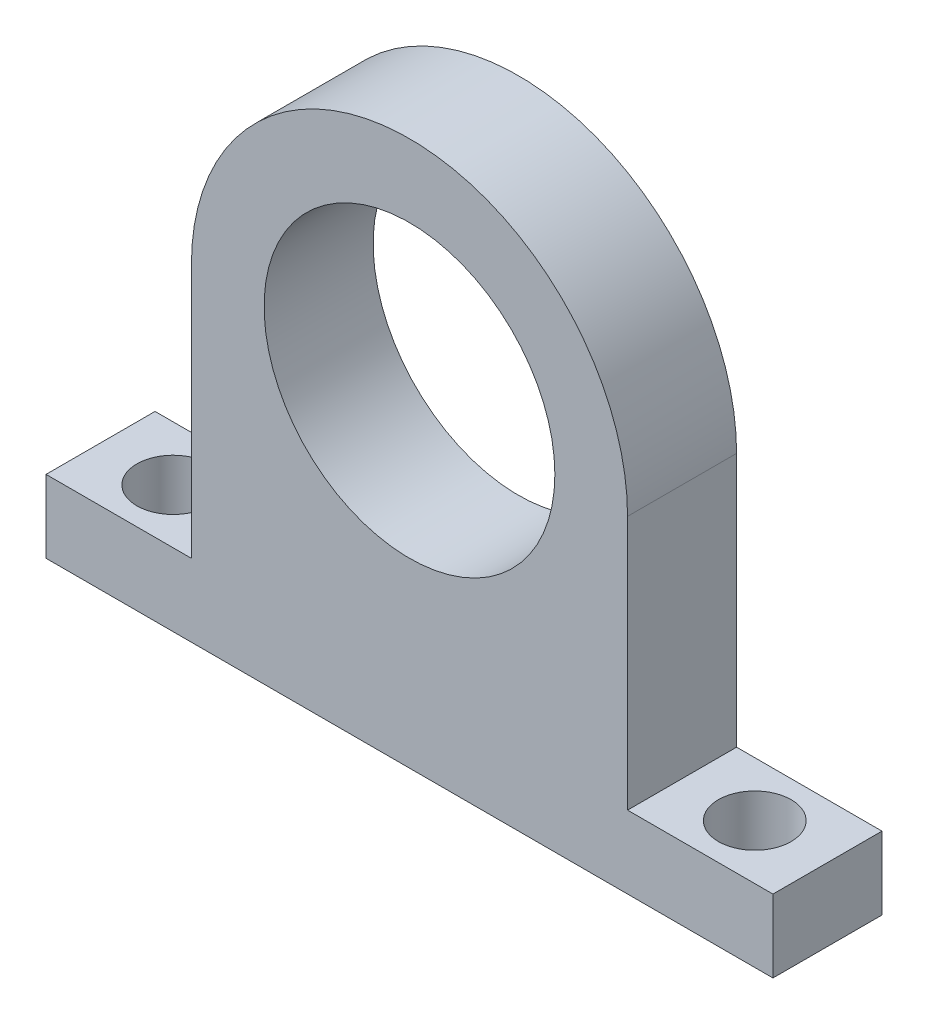
ISO-10303-21;
HEADER;
FILE_DESCRIPTION(('STEP AP214'),'2;1');
FILE_NAME('part.step','',(''),(''),'','','');
FILE_SCHEMA(('AUTOMOTIVE_DESIGN { 1 0 10303 214 1 1 1 1 }'));
ENDSEC;
DATA;
#1=APPLICATION_CONTEXT('core data for automotive mechanical design processes');
#2=APPLICATION_PROTOCOL_DEFINITION('international standard','automotive_design',2000,#1);
#3=PRODUCT_CONTEXT('',#1,'mechanical');
#4=PRODUCT('Part','Part','',(#3));
#5=PRODUCT_RELATED_PRODUCT_CATEGORY('part','',(#4));
#6=PRODUCT_DEFINITION_FORMATION('','',#4);
#7=PRODUCT_DEFINITION_CONTEXT('part definition',#1,'design');
#8=PRODUCT_DEFINITION('design','',#6,#7);
#9=PRODUCT_DEFINITION_SHAPE('','',#8);
#10=(LENGTH_UNIT() NAMED_UNIT(*) SI_UNIT(.MILLI.,.METRE.));
#11=(NAMED_UNIT(*) PLANE_ANGLE_UNIT() SI_UNIT($,.RADIAN.));
#12=(NAMED_UNIT(*) SI_UNIT($,.STERADIAN.) SOLID_ANGLE_UNIT());
#13=UNCERTAINTY_MEASURE_WITH_UNIT(LENGTH_MEASURE(1.E-05),#10,'distance_accuracy_value','');
#14=(GEOMETRIC_REPRESENTATION_CONTEXT(3) GLOBAL_UNCERTAINTY_ASSIGNED_CONTEXT((#13)) GLOBAL_UNIT_ASSIGNED_CONTEXT((#10,
#11,#12)) REPRESENTATION_CONTEXT('',''));
#15=CARTESIAN_POINT('',(0.,0.,0.));
#16=DIRECTION('',(0.,0.,1.));
#17=DIRECTION('',(1.,0.,0.));
#18=AXIS2_PLACEMENT_3D('',#15,#16,#17);
#19=CARTESIAN_POINT('',(0.,0.,3.));
#20=DIRECTION('',(0.,1.,0.));
#21=DIRECTION('',(0.,0.,1.));
#22=AXIS2_PLACEMENT_3D('',#19,#20,#21);
#23=PLANE('',#22);
#24=CARTESIAN_POINT('',(-8.,0.,1.5));
#25=DIRECTION('',(0.,1.,0.));
#26=DIRECTION('',(0.,0.,1.));
#27=AXIS2_PLACEMENT_3D('',#24,#25,#26);
#28=CIRCLE('',#27,1.);
#29=CARTESIAN_POINT('',(-8.,0.,2.5));
#30=VERTEX_POINT('',#29);
#31=EDGE_CURVE('E160',#30,#30,#28,.T.);
#32=ORIENTED_EDGE('',*,*,#31,.T.);
#33=EDGE_LOOP('',(#32));
#34=FACE_BOUND('',#33,.T.);
#35=CARTESIAN_POINT('',(8.,0.,1.5));
#36=DIRECTION('',(0.,1.,0.));
#37=DIRECTION('',(0.,0.,-1.));
#38=AXIS2_PLACEMENT_3D('',#35,#36,#37);
#39=CIRCLE('',#38,1.);
#40=CARTESIAN_POINT('',(8.,0.,0.5));
#41=VERTEX_POINT('',#40);
#42=EDGE_CURVE('E157',#41,#41,#39,.T.);
#43=ORIENTED_EDGE('',*,*,#42,.T.);
#44=EDGE_LOOP('',(#43));
#45=FACE_BOUND('',#44,.T.);
#46=DIRECTION('',(1.,0.,0.));
#47=VECTOR('',#46,1.);
#48=CARTESIAN_POINT('',(0.,0.,0.));
#49=LINE('',#48,#47);
#50=CARTESIAN_POINT('',(-10.,0.,0.));
#51=VERTEX_POINT('',#50);
#52=CARTESIAN_POINT('',(10.,0.,0.));
#53=VERTEX_POINT('',#52);
#54=EDGE_CURVE('E194',#51,#53,#49,.T.);
#55=ORIENTED_EDGE('',*,*,#54,.T.);
#56=DIRECTION('',(0.,0.,-1.));
#57=VECTOR('',#56,1.);
#58=CARTESIAN_POINT('',(10.,0.,3.));
#59=LINE('',#58,#57);
#60=CARTESIAN_POINT('',(10.,0.,3.));
#61=VERTEX_POINT('',#60);
#62=EDGE_CURVE('E11',#61,#53,#59,.T.);
#63=ORIENTED_EDGE('',*,*,#62,.F.);
#64=DIRECTION('',(1.,0.,0.));
#65=VECTOR('',#64,1.);
#66=CARTESIAN_POINT('',(0.,0.,3.));
#67=LINE('',#66,#65);
#68=CARTESIAN_POINT('',(-10.,0.,3.));
#69=VERTEX_POINT('',#68);
#70=EDGE_CURVE('E150',#69,#61,#67,.T.);
#71=ORIENTED_EDGE('',*,*,#70,.F.);
#72=DIRECTION('',(0.,0.,-1.));
#73=VECTOR('',#72,1.);
#74=CARTESIAN_POINT('',(-10.,0.,3.));
#75=LINE('',#74,#73);
#76=EDGE_CURVE('E62',#69,#51,#75,.T.);
#77=ORIENTED_EDGE('',*,*,#76,.T.);
#78=EDGE_LOOP('',(#55,#63,#71,#77));
#79=FACE_BOUND('',#78,.T.);
#80=ADVANCED_FACE('F43',(#34,#45,#79),#23,.F.);
#81=CARTESIAN_POINT('',(10.,0.,3.));
#82=DIRECTION('',(-1.,0.,0.));
#83=DIRECTION('',(0.,-1.,0.));
#84=AXIS2_PLACEMENT_3D('',#81,#82,#83);
#85=PLANE('',#84);
#86=DIRECTION('',(0.,1.,0.));
#87=VECTOR('',#86,1.);
#88=CARTESIAN_POINT('',(10.,0.,0.));
#89=LINE('',#88,#87);
#90=CARTESIAN_POINT('',(10.,2.,0.));
#91=VERTEX_POINT('',#90);
#92=EDGE_CURVE('E191',#53,#91,#89,.T.);
#93=ORIENTED_EDGE('',*,*,#92,.T.);
#94=DIRECTION('',(0.,0.,-1.));
#95=VECTOR('',#94,1.);
#96=CARTESIAN_POINT('',(10.,2.,3.));
#97=LINE('',#96,#95);
#98=CARTESIAN_POINT('',(10.,2.,3.));
#99=VERTEX_POINT('',#98);
#100=EDGE_CURVE('E53',#99,#91,#97,.T.);
#101=ORIENTED_EDGE('',*,*,#100,.F.);
#102=DIRECTION('',(0.,1.,0.));
#103=VECTOR('',#102,1.);
#104=CARTESIAN_POINT('',(10.,0.,3.));
#105=LINE('',#104,#103);
#106=EDGE_CURVE('E100',#61,#99,#105,.T.);
#107=ORIENTED_EDGE('',*,*,#106,.F.);
#108=ORIENTED_EDGE('',*,*,#62,.T.);
#109=EDGE_LOOP('',(#93,#101,#107,#108));
#110=FACE_BOUND('',#109,.T.);
#111=ADVANCED_FACE('F215',(#110),#85,.F.);
#112=CARTESIAN_POINT('',(0.,2.,3.));
#113=DIRECTION('',(0.,1.,0.));
#114=DIRECTION('',(0.,0.,1.));
#115=AXIS2_PLACEMENT_3D('',#112,#113,#114);
#116=PLANE('',#115);
#117=CARTESIAN_POINT('',(8.,2.,1.5));
#118=DIRECTION('',(0.,1.,0.));
#119=DIRECTION('',(0.,0.,1.));
#120=AXIS2_PLACEMENT_3D('',#117,#118,#119);
#121=CIRCLE('',#120,1.);
#122=CARTESIAN_POINT('',(8.,2.,2.5));
#123=VERTEX_POINT('',#122);
#124=EDGE_CURVE('E47',#123,#123,#121,.F.);
#125=ORIENTED_EDGE('',*,*,#124,.T.);
#126=EDGE_LOOP('',(#125));
#127=FACE_BOUND('',#126,.T.);
#128=DIRECTION('',(1.,0.,0.));
#129=VECTOR('',#128,1.);
#130=CARTESIAN_POINT('',(0.,2.,0.));
#131=LINE('',#130,#129);
#132=CARTESIAN_POINT('',(6.,2.,0.));
#133=VERTEX_POINT('',#132);
#134=EDGE_CURVE('E188',#133,#91,#131,.T.);
#135=ORIENTED_EDGE('',*,*,#134,.F.);
#136=DIRECTION('',(0.,0.,-1.));
#137=VECTOR('',#136,1.);
#138=CARTESIAN_POINT('',(6.,2.,3.));
#139=LINE('',#138,#137);
#140=CARTESIAN_POINT('',(6.,2.,3.));
#141=VERTEX_POINT('',#140);
#142=EDGE_CURVE('E172',#141,#133,#139,.T.);
#143=ORIENTED_EDGE('',*,*,#142,.F.);
#144=DIRECTION('',(1.,0.,0.));
#145=VECTOR('',#144,1.);
#146=CARTESIAN_POINT('',(0.,2.,3.));
#147=LINE('',#146,#145);
#148=EDGE_CURVE('E141',#141,#99,#147,.T.);
#149=ORIENTED_EDGE('',*,*,#148,.T.);
#150=ORIENTED_EDGE('',*,*,#100,.T.);
#151=EDGE_LOOP('',(#135,#143,#149,#150));
#152=FACE_BOUND('',#151,.T.);
#153=ADVANCED_FACE('F213',(#127,#152),#116,.T.);
#154=CARTESIAN_POINT('',(6.,0.,3.));
#155=DIRECTION('',(1.,0.,0.));
#156=DIRECTION('',(0.,1.,0.));
#157=AXIS2_PLACEMENT_3D('',#154,#155,#156);
#158=PLANE('',#157);
#159=DIRECTION('',(0.,-1.,0.));
#160=VECTOR('',#159,1.);
#161=CARTESIAN_POINT('',(6.,0.,0.));
#162=LINE('',#161,#160);
#163=CARTESIAN_POINT('',(6.,9.,0.));
#164=VERTEX_POINT('',#163);
#165=EDGE_CURVE('E185',#164,#133,#162,.T.);
#166=ORIENTED_EDGE('',*,*,#165,.F.);
#167=DIRECTION('',(0.,0.,-1.));
#168=VECTOR('',#167,1.);
#169=CARTESIAN_POINT('',(6.,9.,3.));
#170=LINE('',#169,#168);
#171=CARTESIAN_POINT('',(6.,9.,3.));
#172=VERTEX_POINT('',#171);
#173=EDGE_CURVE('E174',#172,#164,#170,.T.);
#174=ORIENTED_EDGE('',*,*,#173,.F.);
#175=DIRECTION('',(0.,-1.,0.));
#176=VECTOR('',#175,1.);
#177=CARTESIAN_POINT('',(6.,0.,3.));
#178=LINE('',#177,#176);
#179=EDGE_CURVE('E146',#172,#141,#178,.T.);
#180=ORIENTED_EDGE('',*,*,#179,.T.);
#181=ORIENTED_EDGE('',*,*,#142,.T.);
#182=EDGE_LOOP('',(#166,#174,#180,#181));
#183=FACE_BOUND('',#182,.T.);
#184=ADVANCED_FACE('F224',(#183),#158,.T.);
#185=CARTESIAN_POINT('',(0.,9.,3.));
#186=DIRECTION('',(0.,0.,-1.));
#187=DIRECTION('',(-1.,0.,0.));
#188=AXIS2_PLACEMENT_3D('',#185,#186,#187);
#189=CYLINDRICAL_SURFACE('',#188,6.);
#190=CARTESIAN_POINT('',(0.,9.,0.));
#191=DIRECTION('',(0.,0.,1.));
#192=DIRECTION('',(1.,0.,0.));
#193=AXIS2_PLACEMENT_3D('',#190,#191,#192);
#194=CIRCLE('',#193,6.);
#195=CARTESIAN_POINT('',(-6.,9.,0.));
#196=VERTEX_POINT('',#195);
#197=EDGE_CURVE('E183',#164,#196,#194,.T.);
#198=ORIENTED_EDGE('',*,*,#197,.T.);
#199=DIRECTION('',(0.,0.,-1.));
#200=VECTOR('',#199,1.);
#201=CARTESIAN_POINT('',(-6.,9.,3.));
#202=LINE('',#201,#200);
#203=CARTESIAN_POINT('',(-6.,9.,3.));
#204=VERTEX_POINT('',#203);
#205=EDGE_CURVE('E136',#204,#196,#202,.T.);
#206=ORIENTED_EDGE('',*,*,#205,.F.);
#207=CARTESIAN_POINT('',(0.,9.,3.));
#208=DIRECTION('',(0.,0.,1.));
#209=DIRECTION('',(1.,0.,0.));
#210=AXIS2_PLACEMENT_3D('',#207,#208,#209);
#211=CIRCLE('',#210,6.);
#212=EDGE_CURVE('E124',#172,#204,#211,.T.);
#213=ORIENTED_EDGE('',*,*,#212,.F.);
#214=ORIENTED_EDGE('',*,*,#173,.T.);
#215=EDGE_LOOP('',(#198,#206,#213,#214));
#216=FACE_BOUND('',#215,.T.);
#217=ADVANCED_FACE('F227',(#216),#189,.T.);
#218=CARTESIAN_POINT('',(-6.,0.,3.));
#219=DIRECTION('',(1.,0.,0.));
#220=DIRECTION('',(0.,1.,0.));
#221=AXIS2_PLACEMENT_3D('',#218,#219,#220);
#222=PLANE('',#221);
#223=DIRECTION('',(0.,-1.,0.));
#224=VECTOR('',#223,1.);
#225=CARTESIAN_POINT('',(-6.,0.,0.));
#226=LINE('',#225,#224);
#227=CARTESIAN_POINT('',(-6.,2.,0.));
#228=VERTEX_POINT('',#227);
#229=EDGE_CURVE('E133',#196,#228,#226,.T.);
#230=ORIENTED_EDGE('',*,*,#229,.T.);
#231=DIRECTION('',(0.,0.,-1.));
#232=VECTOR('',#231,1.);
#233=CARTESIAN_POINT('',(-6.,2.,3.));
#234=LINE('',#233,#232);
#235=CARTESIAN_POINT('',(-6.,2.,3.));
#236=VERTEX_POINT('',#235);
#237=EDGE_CURVE('E130',#236,#228,#234,.T.);
#238=ORIENTED_EDGE('',*,*,#237,.F.);
#239=DIRECTION('',(0.,-1.,0.));
#240=VECTOR('',#239,1.);
#241=CARTESIAN_POINT('',(-6.,0.,3.));
#242=LINE('',#241,#240);
#243=EDGE_CURVE('E116',#204,#236,#242,.T.);
#244=ORIENTED_EDGE('',*,*,#243,.F.);
#245=ORIENTED_EDGE('',*,*,#205,.T.);
#246=EDGE_LOOP('',(#230,#238,#244,#245));
#247=FACE_BOUND('',#246,.T.);
#248=ADVANCED_FACE('F131',(#247),#222,.F.);
#249=CARTESIAN_POINT('',(-8.,2.,1.5));
#250=DIRECTION('',(0.,1.,0.));
#251=DIRECTION('',(0.,0.,1.));
#252=AXIS2_PLACEMENT_3D('',#249,#250,#251);
#253=CIRCLE('',#252,1.);
#254=CARTESIAN_POINT('',(-8.,2.,2.5));
#255=VERTEX_POINT('',#254);
#256=EDGE_CURVE('E162',#255,#255,#253,.F.);
#257=ORIENTED_EDGE('',*,*,#256,.T.);
#258=EDGE_LOOP('',(#257));
#259=FACE_BOUND('',#258,.T.);
#260=CARTESIAN_POINT('',(-10.,2.,0.));
#261=VERTEX_POINT('',#260);
#262=EDGE_CURVE('E181',#261,#228,#131,.T.);
#263=ORIENTED_EDGE('',*,*,#262,.F.);
#264=DIRECTION('',(0.,0.,-1.));
#265=VECTOR('',#264,1.);
#266=CARTESIAN_POINT('',(-10.,2.,3.));
#267=LINE('',#266,#265);
#268=CARTESIAN_POINT('',(-10.,2.,3.));
#269=VERTEX_POINT('',#268);
#270=EDGE_CURVE('E88',#269,#261,#267,.T.);
#271=ORIENTED_EDGE('',*,*,#270,.F.);
#272=EDGE_CURVE('E121',#269,#236,#147,.T.);
#273=ORIENTED_EDGE('',*,*,#272,.T.);
#274=ORIENTED_EDGE('',*,*,#237,.T.);
#275=EDGE_LOOP('',(#263,#271,#273,#274));
#276=FACE_BOUND('',#275,.T.);
#277=ADVANCED_FACE('F138',(#259,#276),#116,.T.);
#278=CARTESIAN_POINT('',(0.,9.,3.));
#279=DIRECTION('',(0.,0.,-1.));
#280=DIRECTION('',(-1.,0.,0.));
#281=AXIS2_PLACEMENT_3D('',#278,#279,#280);
#282=CYLINDRICAL_SURFACE('',#281,4.);
#283=CARTESIAN_POINT('',(0.,9.,3.));
#284=DIRECTION('',(0.,0.,1.));
#285=DIRECTION('',(1.,0.,0.));
#286=AXIS2_PLACEMENT_3D('',#283,#284,#285);
#287=CIRCLE('',#286,4.);
#288=CARTESIAN_POINT('',(4.,9.,3.));
#289=VERTEX_POINT('',#288);
#290=EDGE_CURVE('E151',#289,#289,#287,.T.);
#291=ORIENTED_EDGE('',*,*,#290,.T.);
#292=EDGE_LOOP('',(#291));
#293=FACE_BOUND('',#292,.T.);
#294=CARTESIAN_POINT('',(0.,9.,0.));
#295=DIRECTION('',(0.,0.,1.));
#296=DIRECTION('',(1.,0.,0.));
#297=AXIS2_PLACEMENT_3D('',#294,#295,#296);
#298=CIRCLE('',#297,4.);
#299=CARTESIAN_POINT('',(4.,9.,0.));
#300=VERTEX_POINT('',#299);
#301=EDGE_CURVE('E169',#300,#300,#298,.T.);
#302=ORIENTED_EDGE('',*,*,#301,.F.);
#303=EDGE_LOOP('',(#302));
#304=FACE_BOUND('',#303,.T.);
#305=ADVANCED_FACE('F45',(#293,#304),#282,.F.);
#306=CARTESIAN_POINT('',(-10.,0.,3.));
#307=DIRECTION('',(-1.,0.,0.));
#308=DIRECTION('',(0.,0.,1.));
#309=AXIS2_PLACEMENT_3D('',#306,#307,#308);
#310=PLANE('',#309);
#311=DIRECTION('',(0.,1.,0.));
#312=VECTOR('',#311,1.);
#313=CARTESIAN_POINT('',(-10.,0.,0.));
#314=LINE('',#313,#312);
#315=EDGE_CURVE('E156',#51,#261,#314,.T.);
#316=ORIENTED_EDGE('',*,*,#315,.F.);
#317=ORIENTED_EDGE('',*,*,#76,.F.);
#318=DIRECTION('',(0.,1.,0.));
#319=VECTOR('',#318,1.);
#320=CARTESIAN_POINT('',(-10.,0.,3.));
#321=LINE('',#320,#319);
#322=EDGE_CURVE('E139',#69,#269,#321,.T.);
#323=ORIENTED_EDGE('',*,*,#322,.T.);
#324=ORIENTED_EDGE('',*,*,#270,.T.);
#325=EDGE_LOOP('',(#316,#317,#323,#324));
#326=FACE_BOUND('',#325,.T.);
#327=ADVANCED_FACE('F204',(#326),#310,.T.);
#328=CARTESIAN_POINT('',(0.,0.,3.));
#329=DIRECTION('',(0.,0.,1.));
#330=DIRECTION('',(1.,0.,0.));
#331=AXIS2_PLACEMENT_3D('',#328,#329,#330);
#332=PLANE('',#331);
#333=ORIENTED_EDGE('',*,*,#290,.F.);
#334=EDGE_LOOP('',(#333));
#335=FACE_BOUND('',#334,.T.);
#336=ORIENTED_EDGE('',*,*,#70,.T.);
#337=ORIENTED_EDGE('',*,*,#106,.T.);
#338=ORIENTED_EDGE('',*,*,#148,.F.);
#339=ORIENTED_EDGE('',*,*,#179,.F.);
#340=ORIENTED_EDGE('',*,*,#212,.T.);
#341=ORIENTED_EDGE('',*,*,#243,.T.);
#342=ORIENTED_EDGE('',*,*,#272,.F.);
#343=ORIENTED_EDGE('',*,*,#322,.F.);
#344=EDGE_LOOP('',(#336,#337,#338,#339,#340,#341,#342,#343));
#345=FACE_BOUND('',#344,.T.);
#346=ADVANCED_FACE('F118',(#335,#345),#332,.T.);
#347=CARTESIAN_POINT('',(0.,0.,0.));
#348=DIRECTION('',(0.,0.,1.));
#349=DIRECTION('',(1.,0.,0.));
#350=AXIS2_PLACEMENT_3D('',#347,#348,#349);
#351=PLANE('',#350);
#352=ORIENTED_EDGE('',*,*,#301,.T.);
#353=EDGE_LOOP('',(#352));
#354=FACE_BOUND('',#353,.T.);
#355=ORIENTED_EDGE('',*,*,#54,.F.);
#356=ORIENTED_EDGE('',*,*,#315,.T.);
#357=ORIENTED_EDGE('',*,*,#262,.T.);
#358=ORIENTED_EDGE('',*,*,#229,.F.);
#359=ORIENTED_EDGE('',*,*,#197,.F.);
#360=ORIENTED_EDGE('',*,*,#165,.T.);
#361=ORIENTED_EDGE('',*,*,#134,.T.);
#362=ORIENTED_EDGE('',*,*,#92,.F.);
#363=EDGE_LOOP('',(#355,#356,#357,#358,#359,#360,#361,#362));
#364=FACE_BOUND('',#363,.T.);
#365=ADVANCED_FACE('F200',(#354,#364),#351,.F.);
#366=CARTESIAN_POINT('',(-8.,15.,1.5));
#367=DIRECTION('',(0.,-1.,0.));
#368=DIRECTION('',(0.,0.,-1.));
#369=AXIS2_PLACEMENT_3D('',#366,#367,#368);
#370=CYLINDRICAL_SURFACE('',#369,1.);
#371=ORIENTED_EDGE('',*,*,#256,.F.);
#372=EDGE_LOOP('',(#371));
#373=FACE_BOUND('',#372,.T.);
#374=ORIENTED_EDGE('',*,*,#31,.F.);
#375=EDGE_LOOP('',(#374));
#376=FACE_BOUND('',#375,.T.);
#377=ADVANCED_FACE('F234',(#373,#376),#370,.F.);
#378=CARTESIAN_POINT('',(8.,15.,1.5));
#379=DIRECTION('',(0.,-1.,0.));
#380=DIRECTION('',(0.,0.,-1.));
#381=AXIS2_PLACEMENT_3D('',#378,#379,#380);
#382=CYLINDRICAL_SURFACE('',#381,1.);
#383=ORIENTED_EDGE('',*,*,#124,.F.);
#384=EDGE_LOOP('',(#383));
#385=FACE_BOUND('',#384,.T.);
#386=ORIENTED_EDGE('',*,*,#42,.F.);
#387=EDGE_LOOP('',(#386));
#388=FACE_BOUND('',#387,.T.);
#389=ADVANCED_FACE('F238',(#385,#388),#382,.F.);
#390=CLOSED_SHELL('',(#80,#111,#153,#184,#217,#248,#277,#305,#327,#346,#365,#377,#389));
#391=MANIFOLD_SOLID_BREP('B2',#390);
#392=ADVANCED_BREP_SHAPE_REPRESENTATION('',(#18,#391),#14);
#393=SHAPE_DEFINITION_REPRESENTATION(#9,#392);
ENDSEC;
END-ISO-10303-21;
